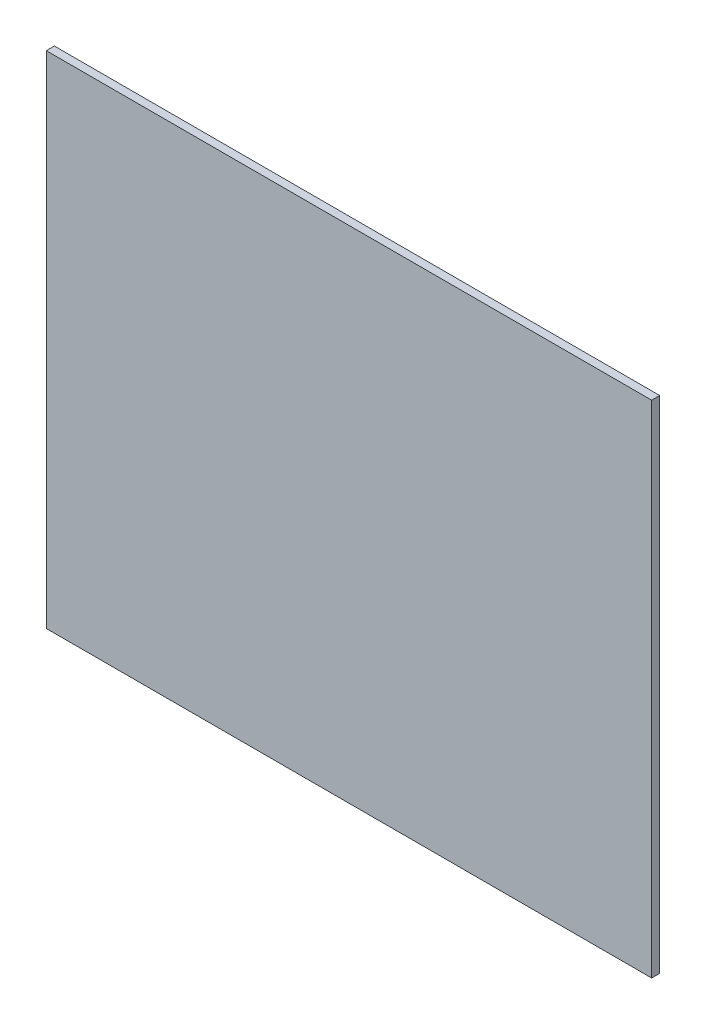
ISO-10303-21;
HEADER;
FILE_DESCRIPTION(('STEP AP214'),'2;1');
FILE_NAME('part.step','',(''),(''),'','','');
FILE_SCHEMA(('AUTOMOTIVE_DESIGN { 1 0 10303 214 1 1 1 1 }'));
ENDSEC;
DATA;
#1=APPLICATION_CONTEXT('core data for automotive mechanical design processes');
#2=APPLICATION_PROTOCOL_DEFINITION('international standard','automotive_design',2000,#1);
#3=PRODUCT_CONTEXT('',#1,'mechanical');
#4=PRODUCT('Part','Part','',(#3));
#5=PRODUCT_RELATED_PRODUCT_CATEGORY('part','',(#4));
#6=PRODUCT_DEFINITION_FORMATION('','',#4);
#7=PRODUCT_DEFINITION_CONTEXT('part definition',#1,'design');
#8=PRODUCT_DEFINITION('design','',#6,#7);
#9=PRODUCT_DEFINITION_SHAPE('','',#8);
#10=(LENGTH_UNIT() NAMED_UNIT(*) SI_UNIT(.MILLI.,.METRE.));
#11=(NAMED_UNIT(*) PLANE_ANGLE_UNIT() SI_UNIT($,.RADIAN.));
#12=(NAMED_UNIT(*) SI_UNIT($,.STERADIAN.) SOLID_ANGLE_UNIT());
#13=UNCERTAINTY_MEASURE_WITH_UNIT(LENGTH_MEASURE(1.E-05),#10,'distance_accuracy_value','');
#14=(GEOMETRIC_REPRESENTATION_CONTEXT(3) GLOBAL_UNCERTAINTY_ASSIGNED_CONTEXT((#13)) GLOBAL_UNIT_ASSIGNED_CONTEXT((#10,
#11,#12)) REPRESENTATION_CONTEXT('',''));
#15=CARTESIAN_POINT('',(0.,0.,0.));
#16=DIRECTION('',(0.,0.,1.));
#17=DIRECTION('',(1.,0.,0.));
#18=AXIS2_PLACEMENT_3D('',#15,#16,#17);
#19=CARTESIAN_POINT('',(0.,0.,5.));
#20=DIRECTION('',(-1.,0.,0.));
#21=DIRECTION('',(0.,-1.,0.));
#22=AXIS2_PLACEMENT_3D('',#19,#20,#21);
#23=PLANE('',#22);
#24=DIRECTION('',(0.,1.,0.));
#25=VECTOR('',#24,1.);
#26=CARTESIAN_POINT('',(0.,0.,0.));
#27=LINE('',#26,#25);
#28=CARTESIAN_POINT('',(0.,0.,0.));
#29=VERTEX_POINT('',#28);
#30=CARTESIAN_POINT('',(0.,310.,0.));
#31=VERTEX_POINT('',#30);
#32=EDGE_CURVE('E107',#29,#31,#27,.T.);
#33=ORIENTED_EDGE('',*,*,#32,.T.);
#34=DIRECTION('',(0.,0.,-1.));
#35=VECTOR('',#34,1.);
#36=CARTESIAN_POINT('',(0.,310.,5.));
#37=LINE('',#36,#35);
#38=CARTESIAN_POINT('',(0.,310.,5.));
#39=VERTEX_POINT('',#38);
#40=EDGE_CURVE('E11',#39,#31,#37,.T.);
#41=ORIENTED_EDGE('',*,*,#40,.F.);
#42=DIRECTION('',(0.,1.,0.));
#43=VECTOR('',#42,1.);
#44=CARTESIAN_POINT('',(0.,0.,5.));
#45=LINE('',#44,#43);
#46=CARTESIAN_POINT('',(0.,0.,5.));
#47=VERTEX_POINT('',#46);
#48=EDGE_CURVE('E91',#47,#39,#45,.T.);
#49=ORIENTED_EDGE('',*,*,#48,.F.);
#50=DIRECTION('',(0.,0.,-1.));
#51=VECTOR('',#50,1.);
#52=CARTESIAN_POINT('',(0.,0.,5.));
#53=LINE('',#52,#51);
#54=EDGE_CURVE('E103',#47,#29,#53,.T.);
#55=ORIENTED_EDGE('',*,*,#54,.T.);
#56=EDGE_LOOP('',(#33,#41,#49,#55));
#57=FACE_BOUND('',#56,.T.);
#58=ADVANCED_FACE('F39',(#57),#23,.F.);
#59=CARTESIAN_POINT('',(0.,310.,5.));
#60=DIRECTION('',(0.,-1.,0.));
#61=DIRECTION('',(1.,0.,0.));
#62=AXIS2_PLACEMENT_3D('',#59,#60,#61);
#63=PLANE('',#62);
#64=DIRECTION('',(-1.,0.,0.));
#65=VECTOR('',#64,1.);
#66=CARTESIAN_POINT('',(0.,310.,0.));
#67=LINE('',#66,#65);
#68=CARTESIAN_POINT('',(-375.,310.,0.));
#69=VERTEX_POINT('',#68);
#70=EDGE_CURVE('E96',#31,#69,#67,.T.);
#71=ORIENTED_EDGE('',*,*,#70,.T.);
#72=DIRECTION('',(0.,0.,-1.));
#73=VECTOR('',#72,1.);
#74=CARTESIAN_POINT('',(-375.,310.,5.));
#75=LINE('',#74,#73);
#76=CARTESIAN_POINT('',(-375.,310.,5.));
#77=VERTEX_POINT('',#76);
#78=EDGE_CURVE('E48',#77,#69,#75,.T.);
#79=ORIENTED_EDGE('',*,*,#78,.F.);
#80=DIRECTION('',(-1.,0.,0.));
#81=VECTOR('',#80,1.);
#82=CARTESIAN_POINT('',(0.,310.,5.));
#83=LINE('',#82,#81);
#84=EDGE_CURVE('E86',#39,#77,#83,.T.);
#85=ORIENTED_EDGE('',*,*,#84,.F.);
#86=ORIENTED_EDGE('',*,*,#40,.T.);
#87=EDGE_LOOP('',(#71,#79,#85,#86));
#88=FACE_BOUND('',#87,.T.);
#89=ADVANCED_FACE('F95',(#88),#63,.F.);
#90=CARTESIAN_POINT('',(-375.,0.,5.));
#91=DIRECTION('',(1.,0.,0.));
#92=DIRECTION('',(0.,0.,-1.));
#93=AXIS2_PLACEMENT_3D('',#90,#91,#92);
#94=PLANE('',#93);
#95=DIRECTION('',(0.,-1.,0.));
#96=VECTOR('',#95,1.);
#97=CARTESIAN_POINT('',(-375.,0.,0.));
#98=LINE('',#97,#96);
#99=CARTESIAN_POINT('',(-375.,0.,0.));
#100=VERTEX_POINT('',#99);
#101=EDGE_CURVE('E73',#69,#100,#98,.T.);
#102=ORIENTED_EDGE('',*,*,#101,.T.);
#103=DIRECTION('',(0.,0.,-1.));
#104=VECTOR('',#103,1.);
#105=CARTESIAN_POINT('',(-375.,0.,5.));
#106=LINE('',#105,#104);
#107=CARTESIAN_POINT('',(-375.,0.,5.));
#108=VERTEX_POINT('',#107);
#109=EDGE_CURVE('E98',#108,#100,#106,.T.);
#110=ORIENTED_EDGE('',*,*,#109,.F.);
#111=DIRECTION('',(0.,-1.,0.));
#112=VECTOR('',#111,1.);
#113=CARTESIAN_POINT('',(-375.,0.,5.));
#114=LINE('',#113,#112);
#115=EDGE_CURVE('E89',#77,#108,#114,.T.);
#116=ORIENTED_EDGE('',*,*,#115,.F.);
#117=ORIENTED_EDGE('',*,*,#78,.T.);
#118=EDGE_LOOP('',(#102,#110,#116,#117));
#119=FACE_BOUND('',#118,.T.);
#120=ADVANCED_FACE('F99',(#119),#94,.F.);
#121=CARTESIAN_POINT('',(0.,0.,5.));
#122=DIRECTION('',(0.,1.,0.));
#123=DIRECTION('',(-1.,0.,0.));
#124=AXIS2_PLACEMENT_3D('',#121,#122,#123);
#125=PLANE('',#124);
#126=DIRECTION('',(1.,0.,0.));
#127=VECTOR('',#126,1.);
#128=CARTESIAN_POINT('',(0.,0.,0.));
#129=LINE('',#128,#127);
#130=EDGE_CURVE('E79',#100,#29,#129,.T.);
#131=ORIENTED_EDGE('',*,*,#130,.T.);
#132=ORIENTED_EDGE('',*,*,#54,.F.);
#133=DIRECTION('',(1.,0.,0.));
#134=VECTOR('',#133,1.);
#135=CARTESIAN_POINT('',(0.,0.,5.));
#136=LINE('',#135,#134);
#137=EDGE_CURVE('E56',#108,#47,#136,.T.);
#138=ORIENTED_EDGE('',*,*,#137,.F.);
#139=ORIENTED_EDGE('',*,*,#109,.T.);
#140=EDGE_LOOP('',(#131,#132,#138,#139));
#141=FACE_BOUND('',#140,.T.);
#142=ADVANCED_FACE('F120',(#141),#125,.F.);
#143=CARTESIAN_POINT('',(0.,0.,5.));
#144=DIRECTION('',(0.,0.,1.));
#145=DIRECTION('',(1.,0.,0.));
#146=AXIS2_PLACEMENT_3D('',#143,#144,#145);
#147=PLANE('',#146);
#148=ORIENTED_EDGE('',*,*,#48,.T.);
#149=ORIENTED_EDGE('',*,*,#84,.T.);
#150=ORIENTED_EDGE('',*,*,#115,.T.);
#151=ORIENTED_EDGE('',*,*,#137,.T.);
#152=EDGE_LOOP('',(#148,#149,#150,#151));
#153=FACE_BOUND('',#152,.T.);
#154=ADVANCED_FACE('F87',(#153),#147,.T.);
#155=CARTESIAN_POINT('',(0.,0.,0.));
#156=DIRECTION('',(0.,0.,1.));
#157=DIRECTION('',(1.,0.,0.));
#158=AXIS2_PLACEMENT_3D('',#155,#156,#157);
#159=PLANE('',#158);
#160=ORIENTED_EDGE('',*,*,#32,.F.);
#161=ORIENTED_EDGE('',*,*,#130,.F.);
#162=ORIENTED_EDGE('',*,*,#101,.F.);
#163=ORIENTED_EDGE('',*,*,#70,.F.);
#164=EDGE_LOOP('',(#160,#161,#162,#163));
#165=FACE_BOUND('',#164,.T.);
#166=ADVANCED_FACE('F123',(#165),#159,.F.);
#167=CLOSED_SHELL('',(#58,#89,#120,#142,#154,#166));
#168=MANIFOLD_SOLID_BREP('B2',#167);
#169=ADVANCED_BREP_SHAPE_REPRESENTATION('',(#18,#168),#14);
#170=SHAPE_DEFINITION_REPRESENTATION(#9,#169);
ENDSEC;
END-ISO-10303-21;
